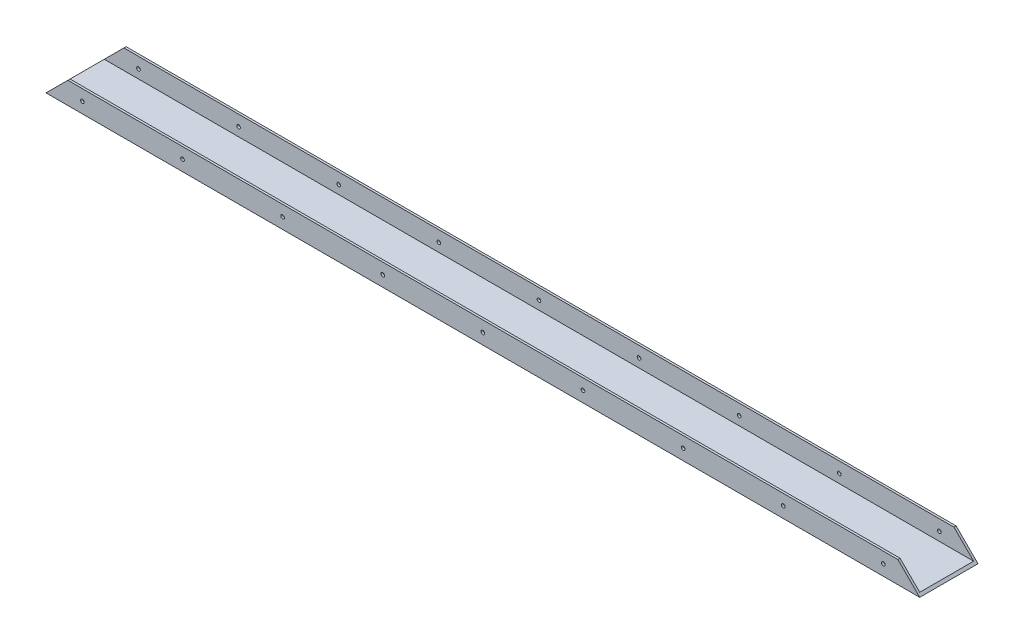
ISO-10303-21;
HEADER;
FILE_DESCRIPTION(('STEP AP214'),'2;1');
FILE_NAME('part.step','',(''),(''),'','','');
FILE_SCHEMA(('AUTOMOTIVE_DESIGN { 1 0 10303 214 1 1 1 1 }'));
ENDSEC;
DATA;
#1=APPLICATION_CONTEXT('core data for automotive mechanical design processes');
#2=APPLICATION_PROTOCOL_DEFINITION('international standard','automotive_design',2000,#1);
#3=PRODUCT_CONTEXT('',#1,'mechanical');
#4=PRODUCT('Part','Part','',(#3));
#5=PRODUCT_RELATED_PRODUCT_CATEGORY('part','',(#4));
#6=PRODUCT_DEFINITION_FORMATION('','',#4);
#7=PRODUCT_DEFINITION_CONTEXT('part definition',#1,'design');
#8=PRODUCT_DEFINITION('design','',#6,#7);
#9=PRODUCT_DEFINITION_SHAPE('','',#8);
#10=(LENGTH_UNIT() NAMED_UNIT(*) SI_UNIT(.MILLI.,.METRE.));
#11=(NAMED_UNIT(*) PLANE_ANGLE_UNIT() SI_UNIT($,.RADIAN.));
#12=(NAMED_UNIT(*) SI_UNIT($,.STERADIAN.) SOLID_ANGLE_UNIT());
#13=UNCERTAINTY_MEASURE_WITH_UNIT(LENGTH_MEASURE(1.E-05),#10,'distance_accuracy_value','');
#14=(GEOMETRIC_REPRESENTATION_CONTEXT(3) GLOBAL_UNCERTAINTY_ASSIGNED_CONTEXT((#13)) GLOBAL_UNIT_ASSIGNED_CONTEXT((#10,
#11,#12)) REPRESENTATION_CONTEXT('',''));
#15=CARTESIAN_POINT('',(0.,0.,0.));
#16=DIRECTION('',(0.,0.,1.));
#17=DIRECTION('',(1.,0.,0.));
#18=AXIS2_PLACEMENT_3D('',#15,#16,#17);
#19=CARTESIAN_POINT('',(600.,15.,-18.5));
#20=DIRECTION('',(0.,0.,-1.));
#21=DIRECTION('',(0.,1.,0.));
#22=AXIS2_PLACEMENT_3D('',#19,#20,#21);
#23=PLANE('',#22);
#24=CARTESIAN_POINT('',(300.,7.49999999999785,-18.5));
#25=DIRECTION('',(0.,0.,-1.));
#26=DIRECTION('',(0.,1.,0.));
#27=AXIS2_PLACEMENT_3D('',#24,#25,#26);
#28=CIRCLE('',#27,1.25000000000005);
#29=CARTESIAN_POINT('',(300.,8.74999999999789,-18.5));
#30=VERTEX_POINT('',#29);
#31=EDGE_CURVE('E196',#30,#30,#28,.T.);
#32=ORIENTED_EDGE('',*,*,#31,.T.);
#33=EDGE_LOOP('',(#32));
#34=FACE_BOUND('',#33,.T.);
#35=CARTESIAN_POINT('',(575.,7.49999999999585,-18.5));
#36=DIRECTION('',(0.,0.,-1.));
#37=DIRECTION('',(0.,1.,0.));
#38=AXIS2_PLACEMENT_3D('',#35,#36,#37);
#39=CIRCLE('',#38,1.25000000000002);
#40=CARTESIAN_POINT('',(575.,8.74999999999586,-18.5));
#41=VERTEX_POINT('',#40);
#42=EDGE_CURVE('E190',#41,#41,#39,.T.);
#43=ORIENTED_EDGE('',*,*,#42,.T.);
#44=EDGE_LOOP('',(#43));
#45=FACE_BOUND('',#44,.T.);
#46=CARTESIAN_POINT('',(506.25,7.4999999999964,-18.5));
#47=DIRECTION('',(0.,0.,-1.));
#48=DIRECTION('',(0.,1.,0.));
#49=AXIS2_PLACEMENT_3D('',#46,#47,#48);
#50=CIRCLE('',#49,1.25000000000005);
#51=CARTESIAN_POINT('',(506.25,8.74999999999645,-18.5));
#52=VERTEX_POINT('',#51);
#53=EDGE_CURVE('E184',#52,#52,#50,.T.);
#54=ORIENTED_EDGE('',*,*,#53,.T.);
#55=EDGE_LOOP('',(#54));
#56=FACE_BOUND('',#55,.T.);
#57=CARTESIAN_POINT('',(437.5,7.49999999999685,-18.5));
#58=DIRECTION('',(0.,0.,-1.));
#59=DIRECTION('',(0.,1.,0.));
#60=AXIS2_PLACEMENT_3D('',#57,#58,#59);
#61=CIRCLE('',#60,1.25000000000005);
#62=CARTESIAN_POINT('',(437.5,8.74999999999689,-18.5));
#63=VERTEX_POINT('',#62);
#64=EDGE_CURVE('E178',#63,#63,#61,.T.);
#65=ORIENTED_EDGE('',*,*,#64,.T.);
#66=EDGE_LOOP('',(#65));
#67=FACE_BOUND('',#66,.T.);
#68=CARTESIAN_POINT('',(368.75,7.4999999999974,-18.5));
#69=DIRECTION('',(0.,0.,-1.));
#70=DIRECTION('',(0.,1.,0.));
#71=AXIS2_PLACEMENT_3D('',#68,#69,#70);
#72=CIRCLE('',#71,1.25000000000008);
#73=CARTESIAN_POINT('',(368.75,8.74999999999748,-18.5));
#74=VERTEX_POINT('',#73);
#75=EDGE_CURVE('E172',#74,#74,#72,.T.);
#76=ORIENTED_EDGE('',*,*,#75,.T.);
#77=EDGE_LOOP('',(#76));
#78=FACE_BOUND('',#77,.T.);
#79=CARTESIAN_POINT('',(231.25,7.49999999999829,-18.5));
#80=DIRECTION('',(0.,0.,-1.));
#81=DIRECTION('',(0.,1.,0.));
#82=AXIS2_PLACEMENT_3D('',#79,#80,#81);
#83=CIRCLE('',#82,1.24999999999962);
#84=CARTESIAN_POINT('',(231.25,8.74999999999791,-18.5));
#85=VERTEX_POINT('',#84);
#86=EDGE_CURVE('E166',#85,#85,#83,.T.);
#87=ORIENTED_EDGE('',*,*,#86,.T.);
#88=EDGE_LOOP('',(#87));
#89=FACE_BOUND('',#88,.T.);
#90=CARTESIAN_POINT('',(162.5,7.49999999999873,-18.5));
#91=DIRECTION('',(0.,0.,-1.));
#92=DIRECTION('',(0.,1.,0.));
#93=AXIS2_PLACEMENT_3D('',#90,#91,#92);
#94=CIRCLE('',#93,1.25000000000002);
#95=CARTESIAN_POINT('',(162.5,8.74999999999875,-18.5));
#96=VERTEX_POINT('',#95);
#97=EDGE_CURVE('E160',#96,#96,#94,.T.);
#98=ORIENTED_EDGE('',*,*,#97,.T.);
#99=EDGE_LOOP('',(#98));
#100=FACE_BOUND('',#99,.T.);
#101=CARTESIAN_POINT('',(93.75,7.49999999999929,-18.5));
#102=DIRECTION('',(0.,0.,-1.));
#103=DIRECTION('',(0.,1.,0.));
#104=AXIS2_PLACEMENT_3D('',#101,#102,#103);
#105=CIRCLE('',#104,1.25000000000005);
#106=CARTESIAN_POINT('',(93.75,8.74999999999934,-18.5));
#107=VERTEX_POINT('',#106);
#108=EDGE_CURVE('E154',#107,#107,#105,.T.);
#109=ORIENTED_EDGE('',*,*,#108,.T.);
#110=EDGE_LOOP('',(#109));
#111=FACE_BOUND('',#110,.T.);
#112=CARTESIAN_POINT('',(24.9999999999999,7.49999999999973,-18.5));
#113=DIRECTION('',(0.,0.,-1.));
#114=DIRECTION('',(0.,1.,0.));
#115=AXIS2_PLACEMENT_3D('',#112,#113,#114);
#116=CIRCLE('',#115,1.25000000000005);
#117=CARTESIAN_POINT('',(24.9999999999999,8.74999999999978,-18.5));
#118=VERTEX_POINT('',#117);
#119=EDGE_CURVE('E148',#118,#118,#116,.T.);
#120=ORIENTED_EDGE('',*,*,#119,.T.);
#121=EDGE_LOOP('',(#120));
#122=FACE_BOUND('',#121,.T.);
#123=DIRECTION('',(-1.,0.,0.));
#124=VECTOR('',#123,1.);
#125=CARTESIAN_POINT('',(600.,1.5,-18.5));
#126=LINE('',#125,#124);
#127=CARTESIAN_POINT('',(598.5,1.5,-18.5));
#128=VERTEX_POINT('',#127);
#129=CARTESIAN_POINT('',(1.50000000000006,1.5,-18.5));
#130=VERTEX_POINT('',#129);
#131=EDGE_CURVE('E11',#128,#130,#126,.T.);
#132=ORIENTED_EDGE('',*,*,#131,.F.);
#133=DIRECTION('',(-0.707106781186548,0.707106781186547,0.));
#134=VECTOR('',#133,1.);
#135=CARTESIAN_POINT('',(592.5,7.5,-18.5));
#136=LINE('',#135,#134);
#137=CARTESIAN_POINT('',(585.,15.,-18.5));
#138=VERTEX_POINT('',#137);
#139=EDGE_CURVE('E142',#128,#138,#136,.T.);
#140=ORIENTED_EDGE('',*,*,#139,.T.);
#141=DIRECTION('',(-1.,0.,0.));
#142=VECTOR('',#141,1.);
#143=CARTESIAN_POINT('',(600.,15.,-18.5));
#144=LINE('',#143,#142);
#145=CARTESIAN_POINT('',(15.,15.,-18.5));
#146=VERTEX_POINT('',#145);
#147=EDGE_CURVE('E202',#138,#146,#144,.T.);
#148=ORIENTED_EDGE('',*,*,#147,.T.);
#149=DIRECTION('',(-0.707106781186548,-0.707106781186547,0.));
#150=VECTOR('',#149,1.);
#151=CARTESIAN_POINT('',(307.5,307.5,-18.4999999999999));
#152=LINE('',#151,#150);
#153=EDGE_CURVE('E134',#146,#130,#152,.T.);
#154=ORIENTED_EDGE('',*,*,#153,.T.);
#155=EDGE_LOOP('',(#132,#140,#148,#154));
#156=FACE_BOUND('',#155,.T.);
#157=ADVANCED_FACE('F32',(#34,#45,#56,#67,#78,#89,#100,#111,#122,#156),#23,.F.);
#158=CARTESIAN_POINT('',(600.,1.5,-18.5));
#159=DIRECTION('',(0.,-1.,0.));
#160=DIRECTION('',(0.,0.,-1.));
#161=AXIS2_PLACEMENT_3D('',#158,#159,#160);
#162=PLANE('',#161);
#163=DIRECTION('',(-1.,0.,0.));
#164=VECTOR('',#163,1.);
#165=CARTESIAN_POINT('',(600.,1.5,18.5));
#166=LINE('',#165,#164);
#167=CARTESIAN_POINT('',(598.5,1.5,18.5));
#168=VERTEX_POINT('',#167);
#169=CARTESIAN_POINT('',(1.50000000000011,1.50000000000006,18.5));
#170=VERTEX_POINT('',#169);
#171=EDGE_CURVE('E40',#168,#170,#166,.T.);
#172=ORIENTED_EDGE('',*,*,#171,.F.);
#173=DIRECTION('',(0.,0.,-1.));
#174=VECTOR('',#173,1.);
#175=CARTESIAN_POINT('',(598.5,1.5,-18.5));
#176=LINE('',#175,#174);
#177=EDGE_CURVE('E129',#168,#128,#176,.T.);
#178=ORIENTED_EDGE('',*,*,#177,.T.);
#179=ORIENTED_EDGE('',*,*,#131,.T.);
#180=DIRECTION('',(0.,0.,1.));
#181=VECTOR('',#180,1.);
#182=CARTESIAN_POINT('',(1.50000000000006,1.5,-18.4999999999999));
#183=LINE('',#182,#181);
#184=EDGE_CURVE('E131',#130,#170,#183,.T.);
#185=ORIENTED_EDGE('',*,*,#184,.T.);
#186=EDGE_LOOP('',(#172,#178,#179,#185));
#187=FACE_BOUND('',#186,.T.);
#188=ADVANCED_FACE('F128',(#187),#162,.F.);
#189=CARTESIAN_POINT('',(600.,1.5,18.5));
#190=DIRECTION('',(0.,0.,1.));
#191=DIRECTION('',(1.,0.,0.));
#192=AXIS2_PLACEMENT_3D('',#189,#190,#191);
#193=PLANE('',#192);
#194=CARTESIAN_POINT('',(300.,7.49999999999784,18.5));
#195=DIRECTION('',(0.,0.,1.));
#196=DIRECTION('',(1.,0.,0.));
#197=AXIS2_PLACEMENT_3D('',#194,#195,#196);
#198=CIRCLE('',#197,1.25000000000005);
#199=CARTESIAN_POINT('',(301.25,7.49999999999784,18.5));
#200=VERTEX_POINT('',#199);
#201=EDGE_CURVE('E193',#200,#200,#198,.T.);
#202=ORIENTED_EDGE('',*,*,#201,.T.);
#203=EDGE_LOOP('',(#202));
#204=FACE_BOUND('',#203,.T.);
#205=CARTESIAN_POINT('',(575.,7.49999999999584,18.5));
#206=DIRECTION('',(0.,0.,1.));
#207=DIRECTION('',(1.,0.,0.));
#208=AXIS2_PLACEMENT_3D('',#205,#206,#207);
#209=CIRCLE('',#208,1.25000000000002);
#210=CARTESIAN_POINT('',(576.25,7.49999999999584,18.5));
#211=VERTEX_POINT('',#210);
#212=EDGE_CURVE('E187',#211,#211,#209,.T.);
#213=ORIENTED_EDGE('',*,*,#212,.T.);
#214=EDGE_LOOP('',(#213));
#215=FACE_BOUND('',#214,.T.);
#216=CARTESIAN_POINT('',(506.25,7.49999999999639,18.5));
#217=DIRECTION('',(0.,0.,1.));
#218=DIRECTION('',(1.,0.,0.));
#219=AXIS2_PLACEMENT_3D('',#216,#217,#218);
#220=CIRCLE('',#219,1.25000000000005);
#221=CARTESIAN_POINT('',(507.5,7.49999999999639,18.5));
#222=VERTEX_POINT('',#221);
#223=EDGE_CURVE('E181',#222,#222,#220,.T.);
#224=ORIENTED_EDGE('',*,*,#223,.T.);
#225=EDGE_LOOP('',(#224));
#226=FACE_BOUND('',#225,.T.);
#227=CARTESIAN_POINT('',(437.5,7.49999999999684,18.5));
#228=DIRECTION('',(0.,0.,1.));
#229=DIRECTION('',(1.,0.,0.));
#230=AXIS2_PLACEMENT_3D('',#227,#228,#229);
#231=CIRCLE('',#230,1.25000000000005);
#232=CARTESIAN_POINT('',(438.75,7.49999999999684,18.5));
#233=VERTEX_POINT('',#232);
#234=EDGE_CURVE('E175',#233,#233,#231,.T.);
#235=ORIENTED_EDGE('',*,*,#234,.T.);
#236=EDGE_LOOP('',(#235));
#237=FACE_BOUND('',#236,.T.);
#238=CARTESIAN_POINT('',(368.75,7.49999999999739,18.5));
#239=DIRECTION('',(0.,0.,1.));
#240=DIRECTION('',(1.,0.,0.));
#241=AXIS2_PLACEMENT_3D('',#238,#239,#240);
#242=CIRCLE('',#241,1.25000000000008);
#243=CARTESIAN_POINT('',(370.,7.49999999999739,18.5));
#244=VERTEX_POINT('',#243);
#245=EDGE_CURVE('E169',#244,#244,#242,.T.);
#246=ORIENTED_EDGE('',*,*,#245,.T.);
#247=EDGE_LOOP('',(#246));
#248=FACE_BOUND('',#247,.T.);
#249=CARTESIAN_POINT('',(231.25,7.49999999999828,18.5));
#250=DIRECTION('',(0.,0.,1.));
#251=DIRECTION('',(1.,0.,0.));
#252=AXIS2_PLACEMENT_3D('',#249,#250,#251);
#253=CIRCLE('',#252,1.24999999999962);
#254=CARTESIAN_POINT('',(232.5,7.49999999999828,18.5));
#255=VERTEX_POINT('',#254);
#256=EDGE_CURVE('E163',#255,#255,#253,.T.);
#257=ORIENTED_EDGE('',*,*,#256,.T.);
#258=EDGE_LOOP('',(#257));
#259=FACE_BOUND('',#258,.T.);
#260=CARTESIAN_POINT('',(162.5,7.49999999999872,18.5));
#261=DIRECTION('',(0.,0.,1.));
#262=DIRECTION('',(1.,0.,0.));
#263=AXIS2_PLACEMENT_3D('',#260,#261,#262);
#264=CIRCLE('',#263,1.25000000000002);
#265=CARTESIAN_POINT('',(163.75,7.49999999999872,18.5));
#266=VERTEX_POINT('',#265);
#267=EDGE_CURVE('E157',#266,#266,#264,.T.);
#268=ORIENTED_EDGE('',*,*,#267,.T.);
#269=EDGE_LOOP('',(#268));
#270=FACE_BOUND('',#269,.T.);
#271=CARTESIAN_POINT('',(93.75,7.49999999999928,18.5));
#272=DIRECTION('',(0.,0.,1.));
#273=DIRECTION('',(1.,0.,0.));
#274=AXIS2_PLACEMENT_3D('',#271,#272,#273);
#275=CIRCLE('',#274,1.25000000000005);
#276=CARTESIAN_POINT('',(95.,7.49999999999928,18.5));
#277=VERTEX_POINT('',#276);
#278=EDGE_CURVE('E151',#277,#277,#275,.T.);
#279=ORIENTED_EDGE('',*,*,#278,.T.);
#280=EDGE_LOOP('',(#279));
#281=FACE_BOUND('',#280,.T.);
#282=CARTESIAN_POINT('',(24.9999999999999,7.49999999999972,18.5));
#283=DIRECTION('',(0.,0.,1.));
#284=DIRECTION('',(1.,0.,0.));
#285=AXIS2_PLACEMENT_3D('',#282,#283,#284);
#286=CIRCLE('',#285,1.25000000000005);
#287=CARTESIAN_POINT('',(26.25,7.49999999999972,18.5));
#288=VERTEX_POINT('',#287);
#289=EDGE_CURVE('E145',#288,#288,#286,.T.);
#290=ORIENTED_EDGE('',*,*,#289,.T.);
#291=EDGE_LOOP('',(#290));
#292=FACE_BOUND('',#291,.T.);
#293=DIRECTION('',(-1.,0.,0.));
#294=VECTOR('',#293,1.);
#295=CARTESIAN_POINT('',(600.,15.,18.5));
#296=LINE('',#295,#294);
#297=CARTESIAN_POINT('',(585.,15.,18.5));
#298=VERTEX_POINT('',#297);
#299=CARTESIAN_POINT('',(15.,15.,18.5));
#300=VERTEX_POINT('',#299);
#301=EDGE_CURVE('E114',#298,#300,#296,.T.);
#302=ORIENTED_EDGE('',*,*,#301,.F.);
#303=DIRECTION('',(0.707106781186548,-0.707106781186547,0.));
#304=VECTOR('',#303,1.);
#305=CARTESIAN_POINT('',(599.25,0.75,18.5));
#306=LINE('',#305,#304);
#307=EDGE_CURVE('E93',#298,#168,#306,.T.);
#308=ORIENTED_EDGE('',*,*,#307,.T.);
#309=ORIENTED_EDGE('',*,*,#171,.T.);
#310=DIRECTION('',(0.707106781186548,0.707106781186547,0.));
#311=VECTOR('',#310,1.);
#312=CARTESIAN_POINT('',(300.75,300.75,18.5));
#313=LINE('',#312,#311);
#314=EDGE_CURVE('E98',#170,#300,#313,.T.);
#315=ORIENTED_EDGE('',*,*,#314,.T.);
#316=EDGE_LOOP('',(#302,#308,#309,#315));
#317=FACE_BOUND('',#316,.T.);
#318=ADVANCED_FACE('F124',(#204,#215,#226,#237,#248,#259,#270,#281,#292,#317),#193,.F.);
#319=CARTESIAN_POINT('',(600.,15.,18.5));
#320=DIRECTION('',(0.,-1.,0.));
#321=DIRECTION('',(0.,0.,-1.));
#322=AXIS2_PLACEMENT_3D('',#319,#320,#321);
#323=PLANE('',#322);
#324=DIRECTION('',(-1.,0.,0.));
#325=VECTOR('',#324,1.);
#326=CARTESIAN_POINT('',(600.,15.,20.));
#327=LINE('',#326,#325);
#328=CARTESIAN_POINT('',(585.,15.,20.));
#329=VERTEX_POINT('',#328);
#330=CARTESIAN_POINT('',(15.,15.,20.));
#331=VERTEX_POINT('',#330);
#332=EDGE_CURVE('E105',#329,#331,#327,.T.);
#333=ORIENTED_EDGE('',*,*,#332,.F.);
#334=DIRECTION('',(0.,0.,-1.));
#335=VECTOR('',#334,1.);
#336=CARTESIAN_POINT('',(585.,15.,20.));
#337=LINE('',#336,#335);
#338=EDGE_CURVE('E90',#329,#298,#337,.T.);
#339=ORIENTED_EDGE('',*,*,#338,.T.);
#340=ORIENTED_EDGE('',*,*,#301,.T.);
#341=DIRECTION('',(0.,0.,-1.));
#342=VECTOR('',#341,1.);
#343=CARTESIAN_POINT('',(15.,15.,20.));
#344=LINE('',#343,#342);
#345=EDGE_CURVE('E113',#331,#300,#344,.T.);
#346=ORIENTED_EDGE('',*,*,#345,.F.);
#347=EDGE_LOOP('',(#333,#339,#340,#346));
#348=FACE_BOUND('',#347,.T.);
#349=ADVANCED_FACE('F112',(#348),#323,.F.);
#350=CARTESIAN_POINT('',(600.,15.,20.));
#351=DIRECTION('',(0.,0.,-1.));
#352=DIRECTION('',(0.,1.,0.));
#353=AXIS2_PLACEMENT_3D('',#350,#351,#352);
#354=PLANE('',#353);
#355=CARTESIAN_POINT('',(300.,7.49999999999784,20.));
#356=DIRECTION('',(0.,0.,-1.));
#357=DIRECTION('',(0.,1.,0.));
#358=AXIS2_PLACEMENT_3D('',#355,#356,#357);
#359=CIRCLE('',#358,1.25000000000005);
#360=CARTESIAN_POINT('',(300.,8.74999999999788,20.));
#361=VERTEX_POINT('',#360);
#362=EDGE_CURVE('E278',#361,#361,#359,.T.);
#363=ORIENTED_EDGE('',*,*,#362,.T.);
#364=EDGE_LOOP('',(#363));
#365=FACE_BOUND('',#364,.T.);
#366=CARTESIAN_POINT('',(575.,7.49999999999584,20.));
#367=DIRECTION('',(0.,0.,-1.));
#368=DIRECTION('',(0.,-1.,0.));
#369=AXIS2_PLACEMENT_3D('',#366,#367,#368);
#370=CIRCLE('',#369,1.25000000000002);
#371=CARTESIAN_POINT('',(575.,6.24999999999582,20.));
#372=VERTEX_POINT('',#371);
#373=EDGE_CURVE('E269',#372,#372,#370,.T.);
#374=ORIENTED_EDGE('',*,*,#373,.T.);
#375=EDGE_LOOP('',(#374));
#376=FACE_BOUND('',#375,.T.);
#377=CARTESIAN_POINT('',(506.25,7.49999999999639,20.));
#378=DIRECTION('',(0.,0.,-1.));
#379=DIRECTION('',(0.,-1.,0.));
#380=AXIS2_PLACEMENT_3D('',#377,#378,#379);
#381=CIRCLE('',#380,1.25000000000005);
#382=CARTESIAN_POINT('',(506.25,6.24999999999635,20.));
#383=VERTEX_POINT('',#382);
#384=EDGE_CURVE('E265',#383,#383,#381,.T.);
#385=ORIENTED_EDGE('',*,*,#384,.T.);
#386=EDGE_LOOP('',(#385));
#387=FACE_BOUND('',#386,.T.);
#388=CARTESIAN_POINT('',(437.5,7.49999999999684,20.));
#389=DIRECTION('',(0.,0.,-1.));
#390=DIRECTION('',(0.,-1.,0.));
#391=AXIS2_PLACEMENT_3D('',#388,#389,#390);
#392=CIRCLE('',#391,1.25000000000005);
#393=CARTESIAN_POINT('',(437.5,6.24999999999679,20.));
#394=VERTEX_POINT('',#393);
#395=EDGE_CURVE('E259',#394,#394,#392,.T.);
#396=ORIENTED_EDGE('',*,*,#395,.T.);
#397=EDGE_LOOP('',(#396));
#398=FACE_BOUND('',#397,.T.);
#399=CARTESIAN_POINT('',(368.75,7.49999999999739,20.));
#400=DIRECTION('',(0.,0.,-1.));
#401=DIRECTION('',(0.,-1.,0.));
#402=AXIS2_PLACEMENT_3D('',#399,#400,#401);
#403=CIRCLE('',#402,1.25000000000008);
#404=CARTESIAN_POINT('',(368.75,6.24999999999731,20.));
#405=VERTEX_POINT('',#404);
#406=EDGE_CURVE('E253',#405,#405,#403,.T.);
#407=ORIENTED_EDGE('',*,*,#406,.T.);
#408=EDGE_LOOP('',(#407));
#409=FACE_BOUND('',#408,.T.);
#410=CARTESIAN_POINT('',(231.25,7.49999999999828,20.));
#411=DIRECTION('',(0.,0.,-1.));
#412=DIRECTION('',(0.,1.,0.));
#413=AXIS2_PLACEMENT_3D('',#410,#411,#412);
#414=CIRCLE('',#413,1.24999999999962);
#415=CARTESIAN_POINT('',(231.25,8.7499999999979,20.));
#416=VERTEX_POINT('',#415);
#417=EDGE_CURVE('E247',#416,#416,#414,.T.);
#418=ORIENTED_EDGE('',*,*,#417,.T.);
#419=EDGE_LOOP('',(#418));
#420=FACE_BOUND('',#419,.T.);
#421=CARTESIAN_POINT('',(162.5,7.49999999999872,20.));
#422=DIRECTION('',(0.,0.,-1.));
#423=DIRECTION('',(0.,1.,0.));
#424=AXIS2_PLACEMENT_3D('',#421,#422,#423);
#425=CIRCLE('',#424,1.25000000000002);
#426=CARTESIAN_POINT('',(162.5,8.74999999999874,20.));
#427=VERTEX_POINT('',#426);
#428=EDGE_CURVE('E241',#427,#427,#425,.T.);
#429=ORIENTED_EDGE('',*,*,#428,.T.);
#430=EDGE_LOOP('',(#429));
#431=FACE_BOUND('',#430,.T.);
#432=CARTESIAN_POINT('',(93.75,7.49999999999928,20.));
#433=DIRECTION('',(0.,0.,-1.));
#434=DIRECTION('',(0.,1.,0.));
#435=AXIS2_PLACEMENT_3D('',#432,#433,#434);
#436=CIRCLE('',#435,1.25000000000005);
#437=CARTESIAN_POINT('',(93.75,8.74999999999933,20.));
#438=VERTEX_POINT('',#437);
#439=EDGE_CURVE('E235',#438,#438,#436,.T.);
#440=ORIENTED_EDGE('',*,*,#439,.T.);
#441=EDGE_LOOP('',(#440));
#442=FACE_BOUND('',#441,.T.);
#443=CARTESIAN_POINT('',(24.9999999999999,7.49999999999972,20.));
#444=DIRECTION('',(0.,0.,-1.));
#445=DIRECTION('',(0.,1.,0.));
#446=AXIS2_PLACEMENT_3D('',#443,#444,#445);
#447=CIRCLE('',#446,1.25000000000005);
#448=CARTESIAN_POINT('',(24.9999999999999,8.74999999999977,20.));
#449=VERTEX_POINT('',#448);
#450=EDGE_CURVE('E224',#449,#449,#447,.T.);
#451=ORIENTED_EDGE('',*,*,#450,.T.);
#452=EDGE_LOOP('',(#451));
#453=FACE_BOUND('',#452,.T.);
#454=DIRECTION('',(-1.,0.,0.));
#455=VECTOR('',#454,1.);
#456=CARTESIAN_POINT('',(600.,0.,20.));
#457=LINE('',#456,#455);
#458=CARTESIAN_POINT('',(600.,0.,20.));
#459=VERTEX_POINT('',#458);
#460=CARTESIAN_POINT('',(0.,0.,20.));
#461=VERTEX_POINT('',#460);
#462=EDGE_CURVE('E107',#459,#461,#457,.T.);
#463=ORIENTED_EDGE('',*,*,#462,.F.);
#464=DIRECTION('',(-0.707106781186548,0.707106781186547,0.));
#465=VECTOR('',#464,1.);
#466=CARTESIAN_POINT('',(585.,15.,20.));
#467=LINE('',#466,#465);
#468=EDGE_CURVE('E46',#459,#329,#467,.T.);
#469=ORIENTED_EDGE('',*,*,#468,.T.);
#470=ORIENTED_EDGE('',*,*,#332,.T.);
#471=DIRECTION('',(-0.707106781186548,-0.707106781186547,0.));
#472=VECTOR('',#471,1.);
#473=CARTESIAN_POINT('',(15.,15.,20.));
#474=LINE('',#473,#472);
#475=EDGE_CURVE('E220',#331,#461,#474,.T.);
#476=ORIENTED_EDGE('',*,*,#475,.T.);
#477=EDGE_LOOP('',(#463,#469,#470,#476));
#478=FACE_BOUND('',#477,.T.);
#479=ADVANCED_FACE('F103',(#365,#376,#387,#398,#409,#420,#431,#442,#453,#478),#354,.F.);
#480=CARTESIAN_POINT('',(600.,0.,20.));
#481=DIRECTION('',(0.,1.,0.));
#482=DIRECTION('',(0.,0.,1.));
#483=AXIS2_PLACEMENT_3D('',#480,#481,#482);
#484=PLANE('',#483);
#485=DIRECTION('',(0.,0.,-1.));
#486=VECTOR('',#485,1.);
#487=CARTESIAN_POINT('',(0.,0.,20.));
#488=LINE('',#487,#486);
#489=CARTESIAN_POINT('',(0.,0.,-20.));
#490=VERTEX_POINT('',#489);
#491=EDGE_CURVE('E199',#461,#490,#488,.T.);
#492=ORIENTED_EDGE('',*,*,#491,.T.);
#493=DIRECTION('',(-1.,0.,0.));
#494=VECTOR('',#493,1.);
#495=CARTESIAN_POINT('',(600.,0.,-20.));
#496=LINE('',#495,#494);
#497=CARTESIAN_POINT('',(600.,0.,-20.));
#498=VERTEX_POINT('',#497);
#499=EDGE_CURVE('E117',#498,#490,#496,.T.);
#500=ORIENTED_EDGE('',*,*,#499,.F.);
#501=DIRECTION('',(0.,0.,-1.));
#502=VECTOR('',#501,1.);
#503=CARTESIAN_POINT('',(600.,0.,20.));
#504=LINE('',#503,#502);
#505=EDGE_CURVE('E200',#459,#498,#504,.T.);
#506=ORIENTED_EDGE('',*,*,#505,.F.);
#507=ORIENTED_EDGE('',*,*,#462,.T.);
#508=EDGE_LOOP('',(#492,#500,#506,#507));
#509=FACE_BOUND('',#508,.T.);
#510=ADVANCED_FACE('F218',(#509),#484,.F.);
#511=CARTESIAN_POINT('',(600.,0.,-20.));
#512=DIRECTION('',(0.,0.,1.));
#513=DIRECTION('',(0.,-1.,0.));
#514=AXIS2_PLACEMENT_3D('',#511,#512,#513);
#515=PLANE('',#514);
#516=CARTESIAN_POINT('',(300.,7.49999999999785,-20.));
#517=DIRECTION('',(0.,0.,-1.));
#518=DIRECTION('',(0.,1.,0.));
#519=AXIS2_PLACEMENT_3D('',#516,#517,#518);
#520=CIRCLE('',#519,1.25000000000005);
#521=CARTESIAN_POINT('',(300.,8.7499999999979,-20.));
#522=VERTEX_POINT('',#521);
#523=EDGE_CURVE('E227',#522,#522,#520,.T.);
#524=ORIENTED_EDGE('',*,*,#523,.F.);
#525=EDGE_LOOP('',(#524));
#526=FACE_BOUND('',#525,.T.);
#527=CARTESIAN_POINT('',(575.,7.49999999999585,-20.));
#528=DIRECTION('',(0.,0.,-1.));
#529=DIRECTION('',(0.,-1.,0.));
#530=AXIS2_PLACEMENT_3D('',#527,#528,#529);
#531=CIRCLE('',#530,1.25000000000002);
#532=CARTESIAN_POINT('',(575.,6.24999999999583,-20.));
#533=VERTEX_POINT('',#532);
#534=EDGE_CURVE('E273',#533,#533,#531,.T.);
#535=ORIENTED_EDGE('',*,*,#534,.F.);
#536=EDGE_LOOP('',(#535));
#537=FACE_BOUND('',#536,.T.);
#538=CARTESIAN_POINT('',(506.25,7.4999999999964,-20.));
#539=DIRECTION('',(0.,0.,-1.));
#540=DIRECTION('',(0.,-1.,0.));
#541=AXIS2_PLACEMENT_3D('',#538,#539,#540);
#542=CIRCLE('',#541,1.25000000000005);
#543=CARTESIAN_POINT('',(506.25,6.24999999999635,-20.));
#544=VERTEX_POINT('',#543);
#545=EDGE_CURVE('E267',#544,#544,#542,.T.);
#546=ORIENTED_EDGE('',*,*,#545,.F.);
#547=EDGE_LOOP('',(#546));
#548=FACE_BOUND('',#547,.T.);
#549=CARTESIAN_POINT('',(437.5,7.49999999999685,-20.));
#550=DIRECTION('',(0.,0.,-1.));
#551=DIRECTION('',(0.,-1.,0.));
#552=AXIS2_PLACEMENT_3D('',#549,#550,#551);
#553=CIRCLE('',#552,1.25000000000005);
#554=CARTESIAN_POINT('',(437.5,6.2499999999968,-20.));
#555=VERTEX_POINT('',#554);
#556=EDGE_CURVE('E262',#555,#555,#553,.T.);
#557=ORIENTED_EDGE('',*,*,#556,.F.);
#558=EDGE_LOOP('',(#557));
#559=FACE_BOUND('',#558,.T.);
#560=CARTESIAN_POINT('',(368.75,7.4999999999974,-20.));
#561=DIRECTION('',(0.,0.,-1.));
#562=DIRECTION('',(0.,-1.,0.));
#563=AXIS2_PLACEMENT_3D('',#560,#561,#562);
#564=CIRCLE('',#563,1.25000000000008);
#565=CARTESIAN_POINT('',(368.75,6.24999999999732,-20.));
#566=VERTEX_POINT('',#565);
#567=EDGE_CURVE('E256',#566,#566,#564,.T.);
#568=ORIENTED_EDGE('',*,*,#567,.F.);
#569=EDGE_LOOP('',(#568));
#570=FACE_BOUND('',#569,.T.);
#571=CARTESIAN_POINT('',(231.25,7.49999999999829,-20.));
#572=DIRECTION('',(0.,0.,-1.));
#573=DIRECTION('',(0.,1.,0.));
#574=AXIS2_PLACEMENT_3D('',#571,#572,#573);
#575=CIRCLE('',#574,1.24999999999962);
#576=CARTESIAN_POINT('',(231.25,8.74999999999791,-20.));
#577=VERTEX_POINT('',#576);
#578=EDGE_CURVE('E250',#577,#577,#575,.T.);
#579=ORIENTED_EDGE('',*,*,#578,.F.);
#580=EDGE_LOOP('',(#579));
#581=FACE_BOUND('',#580,.T.);
#582=CARTESIAN_POINT('',(162.5,7.49999999999873,-20.));
#583=DIRECTION('',(0.,0.,-1.));
#584=DIRECTION('',(0.,1.,0.));
#585=AXIS2_PLACEMENT_3D('',#582,#583,#584);
#586=CIRCLE('',#585,1.25000000000002);
#587=CARTESIAN_POINT('',(162.5,8.74999999999875,-20.));
#588=VERTEX_POINT('',#587);
#589=EDGE_CURVE('E244',#588,#588,#586,.T.);
#590=ORIENTED_EDGE('',*,*,#589,.F.);
#591=EDGE_LOOP('',(#590));
#592=FACE_BOUND('',#591,.T.);
#593=CARTESIAN_POINT('',(93.75,7.49999999999929,-20.));
#594=DIRECTION('',(0.,0.,-1.));
#595=DIRECTION('',(0.,1.,0.));
#596=AXIS2_PLACEMENT_3D('',#593,#594,#595);
#597=CIRCLE('',#596,1.25000000000005);
#598=CARTESIAN_POINT('',(93.75,8.74999999999934,-20.));
#599=VERTEX_POINT('',#598);
#600=EDGE_CURVE('E238',#599,#599,#597,.T.);
#601=ORIENTED_EDGE('',*,*,#600,.F.);
#602=EDGE_LOOP('',(#601));
#603=FACE_BOUND('',#602,.T.);
#604=CARTESIAN_POINT('',(24.9999999999999,7.49999999999973,-20.));
#605=DIRECTION('',(0.,0.,-1.));
#606=DIRECTION('',(0.,1.,0.));
#607=AXIS2_PLACEMENT_3D('',#604,#605,#606);
#608=CIRCLE('',#607,1.25000000000005);
#609=CARTESIAN_POINT('',(24.9999999999999,8.74999999999978,-20.));
#610=VERTEX_POINT('',#609);
#611=EDGE_CURVE('E232',#610,#610,#608,.T.);
#612=ORIENTED_EDGE('',*,*,#611,.F.);
#613=EDGE_LOOP('',(#612));
#614=FACE_BOUND('',#613,.T.);
#615=DIRECTION('',(-1.,0.,0.));
#616=VECTOR('',#615,1.);
#617=CARTESIAN_POINT('',(600.,15.,-20.));
#618=LINE('',#617,#616);
#619=CARTESIAN_POINT('',(585.,15.,-20.));
#620=VERTEX_POINT('',#619);
#621=CARTESIAN_POINT('',(15.,15.,-20.));
#622=VERTEX_POINT('',#621);
#623=EDGE_CURVE('E207',#620,#622,#618,.T.);
#624=ORIENTED_EDGE('',*,*,#623,.F.);
#625=DIRECTION('',(-0.707106781186548,0.707106781186547,0.));
#626=VECTOR('',#625,1.);
#627=CARTESIAN_POINT('',(585.,15.,-20.));
#628=LINE('',#627,#626);
#629=EDGE_CURVE('E109',#498,#620,#628,.T.);
#630=ORIENTED_EDGE('',*,*,#629,.F.);
#631=ORIENTED_EDGE('',*,*,#499,.T.);
#632=DIRECTION('',(-0.707106781186548,-0.707106781186547,0.));
#633=VECTOR('',#632,1.);
#634=CARTESIAN_POINT('',(15.,15.,-20.));
#635=LINE('',#634,#633);
#636=EDGE_CURVE('E216',#622,#490,#635,.T.);
#637=ORIENTED_EDGE('',*,*,#636,.F.);
#638=EDGE_LOOP('',(#624,#630,#631,#637));
#639=FACE_BOUND('',#638,.T.);
#640=ADVANCED_FACE('F215',(#526,#537,#548,#559,#570,#581,#592,#603,#614,#639),#515,.F.);
#641=CARTESIAN_POINT('',(600.,15.,-20.));
#642=DIRECTION('',(0.,-1.,0.));
#643=DIRECTION('',(0.,0.,-1.));
#644=AXIS2_PLACEMENT_3D('',#641,#642,#643);
#645=PLANE('',#644);
#646=ORIENTED_EDGE('',*,*,#147,.F.);
#647=EDGE_CURVE('E99',#138,#620,#337,.T.);
#648=ORIENTED_EDGE('',*,*,#647,.T.);
#649=ORIENTED_EDGE('',*,*,#623,.T.);
#650=EDGE_CURVE('E221',#146,#622,#344,.T.);
#651=ORIENTED_EDGE('',*,*,#650,.F.);
#652=EDGE_LOOP('',(#646,#648,#649,#651));
#653=FACE_BOUND('',#652,.T.);
#654=ADVANCED_FACE('F292',(#653),#645,.F.);
#655=CARTESIAN_POINT('',(15.,15.,20.));
#656=DIRECTION('',(0.707106781186547,-0.707106781186548,0.));
#657=DIRECTION('',(0.707106781186548,0.707106781186547,0.));
#658=AXIS2_PLACEMENT_3D('',#655,#656,#657);
#659=PLANE('',#658);
#660=ORIENTED_EDGE('',*,*,#650,.T.);
#661=ORIENTED_EDGE('',*,*,#636,.T.);
#662=ORIENTED_EDGE('',*,*,#491,.F.);
#663=ORIENTED_EDGE('',*,*,#475,.F.);
#664=ORIENTED_EDGE('',*,*,#345,.T.);
#665=ORIENTED_EDGE('',*,*,#314,.F.);
#666=ORIENTED_EDGE('',*,*,#184,.F.);
#667=ORIENTED_EDGE('',*,*,#153,.F.);
#668=EDGE_LOOP('',(#660,#661,#662,#663,#664,#665,#666,#667));
#669=FACE_BOUND('',#668,.T.);
#670=ADVANCED_FACE('F219',(#669),#659,.F.);
#671=CARTESIAN_POINT('',(585.,15.,20.));
#672=DIRECTION('',(-0.707106781186547,-0.707106781186548,0.));
#673=DIRECTION('',(0.707106781186548,-0.707106781186547,0.));
#674=AXIS2_PLACEMENT_3D('',#671,#672,#673);
#675=PLANE('',#674);
#676=ORIENTED_EDGE('',*,*,#177,.F.);
#677=ORIENTED_EDGE('',*,*,#307,.F.);
#678=ORIENTED_EDGE('',*,*,#338,.F.);
#679=ORIENTED_EDGE('',*,*,#468,.F.);
#680=ORIENTED_EDGE('',*,*,#505,.T.);
#681=ORIENTED_EDGE('',*,*,#629,.T.);
#682=ORIENTED_EDGE('',*,*,#647,.F.);
#683=ORIENTED_EDGE('',*,*,#139,.F.);
#684=EDGE_LOOP('',(#676,#677,#678,#679,#680,#681,#682,#683));
#685=FACE_BOUND('',#684,.T.);
#686=ADVANCED_FACE('F91',(#685),#675,.F.);
#687=CARTESIAN_POINT('',(24.9999999999999,7.49999999999972,20.));
#688=DIRECTION('',(0.,0.,-1.));
#689=DIRECTION('',(0.,1.,0.));
#690=AXIS2_PLACEMENT_3D('',#687,#688,#689);
#691=CYLINDRICAL_SURFACE('',#690,1.25000000000005);
#692=ORIENTED_EDGE('',*,*,#611,.T.);
#693=EDGE_LOOP('',(#692));
#694=FACE_BOUND('',#693,.T.);
#695=ORIENTED_EDGE('',*,*,#119,.F.);
#696=EDGE_LOOP('',(#695));
#697=FACE_BOUND('',#696,.T.);
#698=ADVANCED_FACE('F309',(#694,#697),#691,.F.);
#699=CARTESIAN_POINT('',(93.75,7.49999999999928,20.));
#700=DIRECTION('',(0.,0.,-1.));
#701=DIRECTION('',(0.,1.,0.));
#702=AXIS2_PLACEMENT_3D('',#699,#700,#701);
#703=CYLINDRICAL_SURFACE('',#702,1.25000000000005);
#704=ORIENTED_EDGE('',*,*,#600,.T.);
#705=EDGE_LOOP('',(#704));
#706=FACE_BOUND('',#705,.T.);
#707=ORIENTED_EDGE('',*,*,#108,.F.);
#708=EDGE_LOOP('',(#707));
#709=FACE_BOUND('',#708,.T.);
#710=ADVANCED_FACE('F312',(#706,#709),#703,.F.);
#711=CARTESIAN_POINT('',(162.5,7.49999999999872,20.));
#712=DIRECTION('',(0.,0.,-1.));
#713=DIRECTION('',(0.,1.,0.));
#714=AXIS2_PLACEMENT_3D('',#711,#712,#713);
#715=CYLINDRICAL_SURFACE('',#714,1.25000000000002);
#716=ORIENTED_EDGE('',*,*,#589,.T.);
#717=EDGE_LOOP('',(#716));
#718=FACE_BOUND('',#717,.T.);
#719=ORIENTED_EDGE('',*,*,#97,.F.);
#720=EDGE_LOOP('',(#719));
#721=FACE_BOUND('',#720,.T.);
#722=ADVANCED_FACE('F400',(#718,#721),#715,.F.);
#723=CARTESIAN_POINT('',(231.25,7.49999999999828,20.));
#724=DIRECTION('',(0.,0.,-1.));
#725=DIRECTION('',(0.,1.,0.));
#726=AXIS2_PLACEMENT_3D('',#723,#724,#725);
#727=CYLINDRICAL_SURFACE('',#726,1.24999999999962);
#728=ORIENTED_EDGE('',*,*,#578,.T.);
#729=EDGE_LOOP('',(#728));
#730=FACE_BOUND('',#729,.T.);
#731=ORIENTED_EDGE('',*,*,#86,.F.);
#732=EDGE_LOOP('',(#731));
#733=FACE_BOUND('',#732,.T.);
#734=ADVANCED_FACE('F411',(#730,#733),#727,.F.);
#735=CARTESIAN_POINT('',(368.75,7.49999999999739,20.));
#736=DIRECTION('',(0.,0.,-1.));
#737=DIRECTION('',(0.,1.,0.));
#738=AXIS2_PLACEMENT_3D('',#735,#736,#737);
#739=CYLINDRICAL_SURFACE('',#738,1.25000000000008);
#740=ORIENTED_EDGE('',*,*,#567,.T.);
#741=EDGE_LOOP('',(#740));
#742=FACE_BOUND('',#741,.T.);
#743=ORIENTED_EDGE('',*,*,#75,.F.);
#744=EDGE_LOOP('',(#743));
#745=FACE_BOUND('',#744,.T.);
#746=ADVANCED_FACE('F422',(#742,#745),#739,.F.);
#747=CARTESIAN_POINT('',(437.5,7.49999999999684,20.));
#748=DIRECTION('',(0.,0.,-1.));
#749=DIRECTION('',(0.,1.,0.));
#750=AXIS2_PLACEMENT_3D('',#747,#748,#749);
#751=CYLINDRICAL_SURFACE('',#750,1.25000000000005);
#752=ORIENTED_EDGE('',*,*,#556,.T.);
#753=EDGE_LOOP('',(#752));
#754=FACE_BOUND('',#753,.T.);
#755=ORIENTED_EDGE('',*,*,#64,.F.);
#756=EDGE_LOOP('',(#755));
#757=FACE_BOUND('',#756,.T.);
#758=ADVANCED_FACE('F433',(#754,#757),#751,.F.);
#759=CARTESIAN_POINT('',(506.25,7.49999999999639,20.));
#760=DIRECTION('',(0.,0.,-1.));
#761=DIRECTION('',(0.,1.,0.));
#762=AXIS2_PLACEMENT_3D('',#759,#760,#761);
#763=CYLINDRICAL_SURFACE('',#762,1.25000000000005);
#764=ORIENTED_EDGE('',*,*,#545,.T.);
#765=EDGE_LOOP('',(#764));
#766=FACE_BOUND('',#765,.T.);
#767=ORIENTED_EDGE('',*,*,#53,.F.);
#768=EDGE_LOOP('',(#767));
#769=FACE_BOUND('',#768,.T.);
#770=ADVANCED_FACE('F331',(#766,#769),#763,.F.);
#771=CARTESIAN_POINT('',(575.,7.49999999999584,20.));
#772=DIRECTION('',(0.,0.,-1.));
#773=DIRECTION('',(0.,1.,0.));
#774=AXIS2_PLACEMENT_3D('',#771,#772,#773);
#775=CYLINDRICAL_SURFACE('',#774,1.25000000000002);
#776=ORIENTED_EDGE('',*,*,#534,.T.);
#777=EDGE_LOOP('',(#776));
#778=FACE_BOUND('',#777,.T.);
#779=ORIENTED_EDGE('',*,*,#42,.F.);
#780=EDGE_LOOP('',(#779));
#781=FACE_BOUND('',#780,.T.);
#782=ADVANCED_FACE('F453',(#778,#781),#775,.F.);
#783=CARTESIAN_POINT('',(300.,7.49999999999784,20.));
#784=DIRECTION('',(0.,0.,-1.));
#785=DIRECTION('',(0.,1.,0.));
#786=AXIS2_PLACEMENT_3D('',#783,#784,#785);
#787=CYLINDRICAL_SURFACE('',#786,1.25000000000005);
#788=ORIENTED_EDGE('',*,*,#523,.T.);
#789=EDGE_LOOP('',(#788));
#790=FACE_BOUND('',#789,.T.);
#791=ORIENTED_EDGE('',*,*,#31,.F.);
#792=EDGE_LOOP('',(#791));
#793=FACE_BOUND('',#792,.T.);
#794=ADVANCED_FACE('F287',(#790,#793),#787,.F.);
#795=ORIENTED_EDGE('',*,*,#450,.F.);
#796=EDGE_LOOP('',(#795));
#797=FACE_BOUND('',#796,.T.);
#798=ORIENTED_EDGE('',*,*,#289,.F.);
#799=EDGE_LOOP('',(#798));
#800=FACE_BOUND('',#799,.T.);
#801=ADVANCED_FACE('F314',(#797,#800),#691,.F.);
#802=ORIENTED_EDGE('',*,*,#439,.F.);
#803=EDGE_LOOP('',(#802));
#804=FACE_BOUND('',#803,.T.);
#805=ORIENTED_EDGE('',*,*,#278,.F.);
#806=EDGE_LOOP('',(#805));
#807=FACE_BOUND('',#806,.T.);
#808=ADVANCED_FACE('F403',(#804,#807),#703,.F.);
#809=ORIENTED_EDGE('',*,*,#428,.F.);
#810=EDGE_LOOP('',(#809));
#811=FACE_BOUND('',#810,.T.);
#812=ORIENTED_EDGE('',*,*,#267,.F.);
#813=EDGE_LOOP('',(#812));
#814=FACE_BOUND('',#813,.T.);
#815=ADVANCED_FACE('F414',(#811,#814),#715,.F.);
#816=ORIENTED_EDGE('',*,*,#417,.F.);
#817=EDGE_LOOP('',(#816));
#818=FACE_BOUND('',#817,.T.);
#819=ORIENTED_EDGE('',*,*,#256,.F.);
#820=EDGE_LOOP('',(#819));
#821=FACE_BOUND('',#820,.T.);
#822=ADVANCED_FACE('F425',(#818,#821),#727,.F.);
#823=ORIENTED_EDGE('',*,*,#406,.F.);
#824=EDGE_LOOP('',(#823));
#825=FACE_BOUND('',#824,.T.);
#826=ORIENTED_EDGE('',*,*,#245,.F.);
#827=EDGE_LOOP('',(#826));
#828=FACE_BOUND('',#827,.T.);
#829=ADVANCED_FACE('F436',(#825,#828),#739,.F.);
#830=ORIENTED_EDGE('',*,*,#395,.F.);
#831=EDGE_LOOP('',(#830));
#832=FACE_BOUND('',#831,.T.);
#833=ORIENTED_EDGE('',*,*,#234,.F.);
#834=EDGE_LOOP('',(#833));
#835=FACE_BOUND('',#834,.T.);
#836=ADVANCED_FACE('F445',(#832,#835),#751,.F.);
#837=ORIENTED_EDGE('',*,*,#384,.F.);
#838=EDGE_LOOP('',(#837));
#839=FACE_BOUND('',#838,.T.);
#840=ORIENTED_EDGE('',*,*,#223,.F.);
#841=EDGE_LOOP('',(#840));
#842=FACE_BOUND('',#841,.T.);
#843=ADVANCED_FACE('F454',(#839,#842),#763,.F.);
#844=ORIENTED_EDGE('',*,*,#373,.F.);
#845=EDGE_LOOP('',(#844));
#846=FACE_BOUND('',#845,.T.);
#847=ORIENTED_EDGE('',*,*,#212,.F.);
#848=EDGE_LOOP('',(#847));
#849=FACE_BOUND('',#848,.T.);
#850=ADVANCED_FACE('F464',(#846,#849),#775,.F.);
#851=ORIENTED_EDGE('',*,*,#362,.F.);
#852=EDGE_LOOP('',(#851));
#853=FACE_BOUND('',#852,.T.);
#854=ORIENTED_EDGE('',*,*,#201,.F.);
#855=EDGE_LOOP('',(#854));
#856=FACE_BOUND('',#855,.T.);
#857=ADVANCED_FACE('F473',(#853,#856),#787,.F.);
#858=CLOSED_SHELL('',(#157,#188,#318,#349,#479,#510,#640,#654,#670,#686,#698,#710,#722,#734,
#746,#758,#770,#782,#794,#801,#808,#815,#822,#829,#836,#843,#850,#857));
#859=MANIFOLD_SOLID_BREP('B2',#858);
#860=ADVANCED_BREP_SHAPE_REPRESENTATION('',(#18,#859),#14);
#861=SHAPE_DEFINITION_REPRESENTATION(#9,#860);
ENDSEC;
END-ISO-10303-21;
